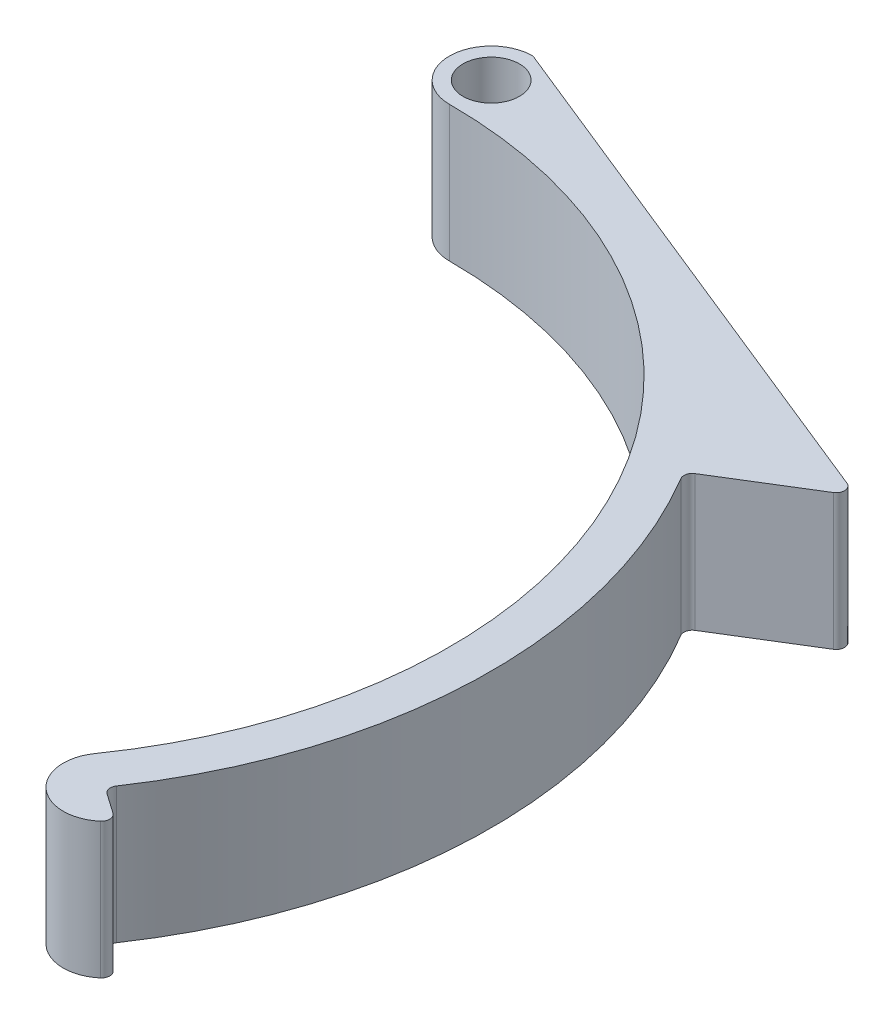
ISO-10303-21;
HEADER;
FILE_DESCRIPTION(('STEP AP214'),'2;1');
FILE_NAME('part.step','',(''),(''),'','','');
FILE_SCHEMA(('AUTOMOTIVE_DESIGN { 1 0 10303 214 1 1 1 1 }'));
ENDSEC;
DATA;
#1=APPLICATION_CONTEXT('core data for automotive mechanical design processes');
#2=APPLICATION_PROTOCOL_DEFINITION('international standard','automotive_design',2000,#1);
#3=PRODUCT_CONTEXT('',#1,'mechanical');
#4=PRODUCT('Part','Part','',(#3));
#5=PRODUCT_RELATED_PRODUCT_CATEGORY('part','',(#4));
#6=PRODUCT_DEFINITION_FORMATION('','',#4);
#7=PRODUCT_DEFINITION_CONTEXT('part definition',#1,'design');
#8=PRODUCT_DEFINITION('design','',#6,#7);
#9=PRODUCT_DEFINITION_SHAPE('','',#8);
#10=(LENGTH_UNIT() NAMED_UNIT(*) SI_UNIT(.MILLI.,.METRE.));
#11=(NAMED_UNIT(*) PLANE_ANGLE_UNIT() SI_UNIT($,.RADIAN.));
#12=(NAMED_UNIT(*) SI_UNIT($,.STERADIAN.) SOLID_ANGLE_UNIT());
#13=UNCERTAINTY_MEASURE_WITH_UNIT(LENGTH_MEASURE(1.E-05),#10,'distance_accuracy_value','');
#14=(GEOMETRIC_REPRESENTATION_CONTEXT(3) GLOBAL_UNCERTAINTY_ASSIGNED_CONTEXT((#13)) GLOBAL_UNIT_ASSIGNED_CONTEXT((#10,
#11,#12)) REPRESENTATION_CONTEXT('',''));
#15=CARTESIAN_POINT('',(0.,0.,0.));
#16=DIRECTION('',(0.,0.,1.));
#17=DIRECTION('',(1.,0.,0.));
#18=AXIS2_PLACEMENT_3D('',#15,#16,#17);
#19=CARTESIAN_POINT('',(18.4107690922549,13.,-45.5602618405853));
#20=DIRECTION('',(0.374663072776281,0.,-0.927161033422908));
#21=DIRECTION('',(-0.927161033422908,0.,-0.374663072776281));
#22=AXIS2_PLACEMENT_3D('',#19,#20,#21);
#23=PLANE('',#22);
#24=DIRECTION('',(0.927161033422908,0.,0.374663072776281));
#25=VECTOR('',#24,1.);
#26=CARTESIAN_POINT('',(18.4107690922549,0.,-45.5602618405853));
#27=LINE('',#26,#25);
#28=CARTESIAN_POINT('',(0.152578115339287,0.,-52.938343628053));
#29=VERTEX_POINT('',#28);
#30=CARTESIAN_POINT('',(50.4547105940548,0.,-32.6113984240491));
#31=VERTEX_POINT('',#30);
#32=EDGE_CURVE('E189',#29,#31,#27,.T.);
#33=ORIENTED_EDGE('',*,*,#32,.F.);
#34=DIRECTION('',(0.,-1.,0.));
#35=VECTOR('',#34,1.);
#36=CARTESIAN_POINT('',(0.152578115339284,13.,-52.938343628053));
#37=LINE('',#36,#35);
#38=CARTESIAN_POINT('',(0.152578115339287,13.,-52.938343628053));
#39=VERTEX_POINT('',#38);
#40=EDGE_CURVE('E231',#29,#39,#37,.F.);
#41=ORIENTED_EDGE('',*,*,#40,.T.);
#42=DIRECTION('',(0.927161033422908,0.,0.374663072776281));
#43=VECTOR('',#42,1.);
#44=CARTESIAN_POINT('',(18.4107690922549,13.,-45.5602618405853));
#45=LINE('',#44,#43);
#46=CARTESIAN_POINT('',(50.4547105940548,13.,-32.6113984240491));
#47=VERTEX_POINT('',#46);
#48=EDGE_CURVE('E165',#39,#47,#45,.T.);
#49=ORIENTED_EDGE('',*,*,#48,.T.);
#50=DIRECTION('',(0.,-1.,0.));
#51=VECTOR('',#50,1.);
#52=CARTESIAN_POINT('',(50.4547105940548,13.,-32.6113984240491));
#53=LINE('',#52,#51);
#54=EDGE_CURVE('E227',#47,#31,#53,.T.);
#55=ORIENTED_EDGE('',*,*,#54,.T.);
#56=EDGE_LOOP('',(#33,#41,#49,#55));
#57=FACE_BOUND('',#56,.T.);
#58=ADVANCED_FACE('F45',(#57),#23,.T.);
#59=CARTESIAN_POINT('',(0.,13.,-49.));
#60=DIRECTION('',(0.,-1.,0.));
#61=DIRECTION('',(0.,0.,-1.));
#62=AXIS2_PLACEMENT_3D('',#59,#60,#61);
#63=CYLINDRICAL_SURFACE('',#62,4.);
#64=CARTESIAN_POINT('',(0.,13.,-49.));
#65=DIRECTION('',(0.,1.,0.));
#66=DIRECTION('',(0.,0.,1.));
#67=AXIS2_PLACEMENT_3D('',#64,#65,#66);
#68=CIRCLE('',#67,4.);
#69=CARTESIAN_POINT('',(0.,13.,-45.));
#70=VERTEX_POINT('',#69);
#71=CARTESIAN_POINT('',(-0.183940428602176,13.,-52.9957685016434));
#72=VERTEX_POINT('',#71);
#73=EDGE_CURVE('E140',#70,#72,#68,.F.);
#74=ORIENTED_EDGE('',*,*,#73,.T.);
#75=DIRECTION('',(0.,-1.,0.));
#76=VECTOR('',#75,1.);
#77=CARTESIAN_POINT('',(-0.183940428602176,13.,-52.9957685016434));
#78=LINE('',#77,#76);
#79=CARTESIAN_POINT('',(-0.183940428602176,0.,-52.9957685016434));
#80=VERTEX_POINT('',#79);
#81=EDGE_CURVE('E148',#72,#80,#78,.T.);
#82=ORIENTED_EDGE('',*,*,#81,.T.);
#83=CARTESIAN_POINT('',(0.,0.,-49.));
#84=DIRECTION('',(0.,1.,0.));
#85=DIRECTION('',(0.,0.,1.));
#86=AXIS2_PLACEMENT_3D('',#83,#84,#85);
#87=CIRCLE('',#86,4.);
#88=CARTESIAN_POINT('',(0.,0.,-45.));
#89=VERTEX_POINT('',#88);
#90=EDGE_CURVE('E143',#89,#80,#87,.F.);
#91=ORIENTED_EDGE('',*,*,#90,.F.);
#92=DIRECTION('',(0.,-1.,0.));
#93=VECTOR('',#92,1.);
#94=CARTESIAN_POINT('',(0.,13.,-45.));
#95=LINE('',#94,#93);
#96=EDGE_CURVE('E135',#70,#89,#95,.T.);
#97=ORIENTED_EDGE('',*,*,#96,.F.);
#98=EDGE_LOOP('',(#74,#82,#91,#97));
#99=FACE_BOUND('',#98,.T.);
#100=ADVANCED_FACE('F137',(#99),#63,.T.);
#101=CARTESIAN_POINT('',(0.,13.,0.));
#102=DIRECTION('',(0.,-1.,0.));
#103=DIRECTION('',(0.,0.,-1.));
#104=AXIS2_PLACEMENT_3D('',#101,#102,#103);
#105=CYLINDRICAL_SURFACE('',#104,45.);
#106=CARTESIAN_POINT('',(0.,0.,0.));
#107=DIRECTION('',(0.,1.,0.));
#108=DIRECTION('',(0.,0.,1.));
#109=AXIS2_PLACEMENT_3D('',#106,#107,#108);
#110=CIRCLE('',#109,45.);
#111=CARTESIAN_POINT('',(36.8618419930047,0.,25.810939635797));
#112=VERTEX_POINT('',#111);
#113=EDGE_CURVE('E195',#89,#112,#110,.F.);
#114=ORIENTED_EDGE('',*,*,#113,.T.);
#115=DIRECTION('',(0.,-1.,0.));
#116=VECTOR('',#115,1.);
#117=CARTESIAN_POINT('',(36.8618419930047,13.,25.810939635797));
#118=LINE('',#117,#116);
#119=CARTESIAN_POINT('',(36.8618419930047,13.,25.810939635797));
#120=VERTEX_POINT('',#119);
#121=EDGE_CURVE('E149',#120,#112,#118,.T.);
#122=ORIENTED_EDGE('',*,*,#121,.F.);
#123=CARTESIAN_POINT('',(0.,13.,0.));
#124=DIRECTION('',(0.,1.,0.));
#125=DIRECTION('',(0.,0.,1.));
#126=AXIS2_PLACEMENT_3D('',#123,#124,#125);
#127=CIRCLE('',#126,45.);
#128=EDGE_CURVE('E153',#70,#120,#127,.F.);
#129=ORIENTED_EDGE('',*,*,#128,.F.);
#130=ORIENTED_EDGE('',*,*,#96,.T.);
#131=EDGE_LOOP('',(#114,#122,#129,#130));
#132=FACE_BOUND('',#131,.T.);
#133=ADVANCED_FACE('F154',(#132),#105,.F.);
#134=CARTESIAN_POINT('',(40.1384501701607,13.,28.1052453812011));
#135=DIRECTION('',(0.,-1.,0.));
#136=DIRECTION('',(0.,0.,-1.));
#137=AXIS2_PLACEMENT_3D('',#134,#135,#136);
#138=CYLINDRICAL_SURFACE('',#137,4.);
#139=CARTESIAN_POINT('',(40.1384501701607,0.,28.1052453812011));
#140=DIRECTION('',(0.,1.,0.));
#141=DIRECTION('',(0.,0.,1.));
#142=AXIS2_PLACEMENT_3D('',#139,#140,#141);
#143=CIRCLE('',#142,4.);
#144=CARTESIAN_POINT('',(42.7374359593527,0.,31.1458494112547));
#145=VERTEX_POINT('',#144);
#146=EDGE_CURVE('E198',#112,#145,#143,.T.);
#147=ORIENTED_EDGE('',*,*,#146,.T.);
#148=DIRECTION('',(0.,-1.,0.));
#149=VECTOR('',#148,1.);
#150=CARTESIAN_POINT('',(42.7374359593527,13.,31.1458494112547));
#151=LINE('',#150,#149);
#152=CARTESIAN_POINT('',(42.7374359593527,13.,31.1458494112547));
#153=VERTEX_POINT('',#152);
#154=EDGE_CURVE('E256',#145,#153,#151,.F.);
#155=ORIENTED_EDGE('',*,*,#154,.T.);
#156=CARTESIAN_POINT('',(40.1384501701607,13.,28.1052453812011));
#157=DIRECTION('',(0.,1.,0.));
#158=DIRECTION('',(0.,0.,1.));
#159=AXIS2_PLACEMENT_3D('',#156,#157,#158);
#160=CIRCLE('',#159,4.);
#161=EDGE_CURVE('E158',#120,#153,#160,.T.);
#162=ORIENTED_EDGE('',*,*,#161,.F.);
#163=ORIENTED_EDGE('',*,*,#121,.T.);
#164=EDGE_LOOP('',(#147,#155,#162,#163));
#165=FACE_BOUND('',#164,.T.);
#166=ADVANCED_FACE('F334',(#165),#138,.T.);
#167=CARTESIAN_POINT('',(0.,13.,0.));
#168=DIRECTION('',(0.573576436351042,0.,-0.819152044288994));
#169=DIRECTION('',(-0.819152044288995,0.,-0.573576436351042));
#170=AXIS2_PLACEMENT_3D('',#167,#168,#169);
#171=PLANE('',#170);
#172=DIRECTION('',(0.819152044288994,0.,0.573576436351042));
#173=VECTOR('',#172,1.);
#174=CARTESIAN_POINT('',(0.,0.,0.));
#175=LINE('',#174,#173);
#176=CARTESIAN_POINT('',(40.7885078383708,0.,28.5604206607529));
#177=VERTEX_POINT('',#176);
#178=CARTESIAN_POINT('',(42.6764999505951,0.,29.8824069698128));
#179=VERTEX_POINT('',#178);
#180=EDGE_CURVE('E202',#177,#179,#175,.T.);
#181=ORIENTED_EDGE('',*,*,#180,.F.);
#182=DIRECTION('',(0.,-1.,0.));
#183=VECTOR('',#182,1.);
#184=CARTESIAN_POINT('',(40.7885078383708,13.,28.5604206607529));
#185=LINE('',#184,#183);
#186=CARTESIAN_POINT('',(40.7885078383708,13.,28.5604206607529));
#187=VERTEX_POINT('',#186);
#188=EDGE_CURVE('E253',#177,#187,#185,.F.);
#189=ORIENTED_EDGE('',*,*,#188,.T.);
#190=DIRECTION('',(0.819152044288994,0.,0.573576436351042));
#191=VECTOR('',#190,1.);
#192=CARTESIAN_POINT('',(0.,13.,0.));
#193=LINE('',#192,#191);
#194=CARTESIAN_POINT('',(42.6764999505951,13.,29.8824069698128));
#195=VERTEX_POINT('',#194);
#196=EDGE_CURVE('E175',#187,#195,#193,.T.);
#197=ORIENTED_EDGE('',*,*,#196,.T.);
#198=DIRECTION('',(0.,1.,0.));
#199=VECTOR('',#198,1.);
#200=CARTESIAN_POINT('',(42.6764999505951,0.,29.8824069698128));
#201=LINE('',#200,#199);
#202=EDGE_CURVE('E249',#195,#179,#201,.F.);
#203=ORIENTED_EDGE('',*,*,#202,.T.);
#204=EDGE_LOOP('',(#181,#189,#197,#203));
#205=FACE_BOUND('',#204,.T.);
#206=ADVANCED_FACE('F319',(#205),#171,.T.);
#207=CARTESIAN_POINT('',(0.,13.,0.));
#208=DIRECTION('',(0.,-1.,0.));
#209=DIRECTION('',(0.,0.,-1.));
#210=AXIS2_PLACEMENT_3D('',#207,#208,#209);
#211=CYLINDRICAL_SURFACE('',#210,49.);
#212=CARTESIAN_POINT('',(0.,13.,0.));
#213=DIRECTION('',(0.,1.,0.));
#214=DIRECTION('',(0.,0.,1.));
#215=AXIS2_PLACEMENT_3D('',#212,#213,#214);
#216=CIRCLE('',#215,49.);
#217=CARTESIAN_POINT('',(40.5847606503038,13.,27.456824342184));
#218=VERTEX_POINT('',#217);
#219=CARTESIAN_POINT('',(42.1148392112088,13.,-25.0467626294103));
#220=VERTEX_POINT('',#219);
#221=EDGE_CURVE('E179',#218,#220,#216,.T.);
#222=ORIENTED_EDGE('',*,*,#221,.F.);
#223=DIRECTION('',(0.,-1.,0.));
#224=VECTOR('',#223,1.);
#225=CARTESIAN_POINT('',(40.5847606503038,13.,27.456824342184));
#226=LINE('',#225,#224);
#227=CARTESIAN_POINT('',(40.5847606503038,0.,27.456824342184));
#228=VERTEX_POINT('',#227);
#229=EDGE_CURVE('E245',#218,#228,#226,.T.);
#230=ORIENTED_EDGE('',*,*,#229,.T.);
#231=CARTESIAN_POINT('',(0.,0.,0.));
#232=DIRECTION('',(0.,1.,0.));
#233=DIRECTION('',(0.,0.,1.));
#234=AXIS2_PLACEMENT_3D('',#231,#232,#233);
#235=CIRCLE('',#234,49.);
#236=CARTESIAN_POINT('',(42.1148392112088,0.,-25.0467626294103));
#237=VERTEX_POINT('',#236);
#238=EDGE_CURVE('E206',#228,#237,#235,.T.);
#239=ORIENTED_EDGE('',*,*,#238,.T.);
#240=DIRECTION('',(0.,-1.,0.));
#241=VECTOR('',#240,1.);
#242=CARTESIAN_POINT('',(42.1148392112088,13.,-25.0467626294103));
#243=LINE('',#242,#241);
#244=EDGE_CURVE('E242',#237,#220,#243,.F.);
#245=ORIENTED_EDGE('',*,*,#244,.T.);
#246=EDGE_LOOP('',(#222,#230,#239,#245));
#247=FACE_BOUND('',#246,.T.);
#248=ADVANCED_FACE('F279',(#247),#211,.T.);
#249=CARTESIAN_POINT('',(0.,13.,-49.));
#250=DIRECTION('',(0.,-1.,0.));
#251=DIRECTION('',(0.,0.,-1.));
#252=AXIS2_PLACEMENT_3D('',#249,#250,#251);
#253=CYLINDRICAL_SURFACE('',#252,2.7);
#254=CARTESIAN_POINT('',(0.,13.,-49.));
#255=DIRECTION('',(0.,1.,0.));
#256=DIRECTION('',(0.,0.,1.));
#257=AXIS2_PLACEMENT_3D('',#254,#255,#256);
#258=CIRCLE('',#257,2.7);
#259=CARTESIAN_POINT('',(0.,13.,-46.3));
#260=VERTEX_POINT('',#259);
#261=EDGE_CURVE('E169',#260,#260,#258,.T.);
#262=ORIENTED_EDGE('',*,*,#261,.T.);
#263=EDGE_LOOP('',(#262));
#264=FACE_BOUND('',#263,.T.);
#265=CARTESIAN_POINT('',(0.,0.,-49.));
#266=DIRECTION('',(0.,1.,0.));
#267=DIRECTION('',(0.,0.,1.));
#268=AXIS2_PLACEMENT_3D('',#265,#266,#267);
#269=CIRCLE('',#268,2.7);
#270=CARTESIAN_POINT('',(0.,0.,-46.3));
#271=VERTEX_POINT('',#270);
#272=EDGE_CURVE('E185',#271,#271,#269,.T.);
#273=ORIENTED_EDGE('',*,*,#272,.F.);
#274=EDGE_LOOP('',(#273));
#275=FACE_BOUND('',#274,.T.);
#276=ADVANCED_FACE('F311',(#264,#275),#253,.F.);
#277=CARTESIAN_POINT('',(0.,13.,0.));
#278=DIRECTION('',(0.524899474172595,0.,0.851164227404637));
#279=DIRECTION('',(0.851164227404637,0.,-0.524899474172595));
#280=AXIS2_PLACEMENT_3D('',#277,#278,#279);
#281=PLANE('',#280);
#282=DIRECTION('',(-0.851164227404637,0.,0.524899474172595));
#283=VECTOR('',#282,1.);
#284=CARTESIAN_POINT('',(0.,0.,0.));
#285=LINE('',#284,#283);
#286=CARTESIAN_POINT('',(50.5748997151719,0.,-31.1887382153871));
#287=VERTEX_POINT('',#286);
#288=CARTESIAN_POINT('',(42.3825088434823,0.,-26.1366207481407));
#289=VERTEX_POINT('',#288);
#290=EDGE_CURVE('E210',#287,#289,#285,.T.);
#291=ORIENTED_EDGE('',*,*,#290,.F.);
#292=DIRECTION('',(0.,-1.,0.));
#293=VECTOR('',#292,1.);
#294=CARTESIAN_POINT('',(50.5748997151719,13.,-31.1887382153871));
#295=LINE('',#294,#293);
#296=CARTESIAN_POINT('',(50.5748997151719,13.,-31.1887382153871));
#297=VERTEX_POINT('',#296);
#298=EDGE_CURVE('E66',#287,#297,#295,.F.);
#299=ORIENTED_EDGE('',*,*,#298,.T.);
#300=DIRECTION('',(-0.851164227404637,0.,0.524899474172595));
#301=VECTOR('',#300,1.);
#302=CARTESIAN_POINT('',(0.,13.,0.));
#303=LINE('',#302,#301);
#304=CARTESIAN_POINT('',(42.3825088434823,13.,-26.1366207481407));
#305=VERTEX_POINT('',#304);
#306=EDGE_CURVE('E182',#297,#305,#303,.T.);
#307=ORIENTED_EDGE('',*,*,#306,.T.);
#308=DIRECTION('',(0.,-1.,0.));
#309=VECTOR('',#308,1.);
#310=CARTESIAN_POINT('',(42.3825088434823,13.,-26.1366207481407));
#311=LINE('',#310,#309);
#312=EDGE_CURVE('E259',#305,#289,#311,.T.);
#313=ORIENTED_EDGE('',*,*,#312,.T.);
#314=EDGE_LOOP('',(#291,#299,#307,#313));
#315=FACE_BOUND('',#314,.T.);
#316=ADVANCED_FACE('F281',(#315),#281,.T.);
#317=CARTESIAN_POINT('',(0.,13.,0.));
#318=DIRECTION('',(0.,1.,0.));
#319=DIRECTION('',(0.,0.,1.));
#320=AXIS2_PLACEMENT_3D('',#317,#318,#319);
#321=PLANE('',#320);
#322=ORIENTED_EDGE('',*,*,#261,.F.);
#323=EDGE_LOOP('',(#322));
#324=FACE_BOUND('',#323,.T.);
#325=ORIENTED_EDGE('',*,*,#48,.F.);
#326=CARTESIAN_POINT('',(-0.147152342881741,13.,-52.1966148013147));
#327=DIRECTION('',(0.,1.,0.));
#328=DIRECTION('',(0.,0.,1.));
#329=AXIS2_PLACEMENT_3D('',#326,#327,#328);
#330=CIRCLE('',#329,0.8);
#331=EDGE_CURVE('E163',#39,#72,#330,.T.);
#332=ORIENTED_EDGE('',*,*,#331,.T.);
#333=ORIENTED_EDGE('',*,*,#73,.F.);
#334=ORIENTED_EDGE('',*,*,#128,.T.);
#335=ORIENTED_EDGE('',*,*,#161,.T.);
#336=CARTESIAN_POINT('',(42.2176388015143,13.,30.537728605244));
#337=DIRECTION('',(0.,1.,0.));
#338=DIRECTION('',(0.,0.,1.));
#339=AXIS2_PLACEMENT_3D('',#336,#337,#338);
#340=CIRCLE('',#339,0.8);
#341=EDGE_CURVE('E237',#153,#195,#340,.T.);
#342=ORIENTED_EDGE('',*,*,#341,.T.);
#343=ORIENTED_EDGE('',*,*,#196,.F.);
#344=CARTESIAN_POINT('',(41.2473689874516,13.,27.9050990253217));
#345=DIRECTION('',(0.,1.,0.));
#346=DIRECTION('',(0.,0.,1.));
#347=AXIS2_PLACEMENT_3D('',#344,#345,#346);
#348=CIRCLE('',#347,0.8);
#349=EDGE_CURVE('E268',#187,#218,#348,.F.);
#350=ORIENTED_EDGE('',*,*,#349,.T.);
#351=ORIENTED_EDGE('',*,*,#221,.T.);
#352=CARTESIAN_POINT('',(42.8024284228204,13.,-25.455689366217));
#353=DIRECTION('',(0.,1.,0.));
#354=DIRECTION('',(0.,0.,1.));
#355=AXIS2_PLACEMENT_3D('',#352,#353,#354);
#356=CIRCLE('',#355,0.8);
#357=EDGE_CURVE('E11',#220,#305,#356,.F.);
#358=ORIENTED_EDGE('',*,*,#357,.T.);
#359=ORIENTED_EDGE('',*,*,#306,.F.);
#360=CARTESIAN_POINT('',(50.1549801358338,13.,-31.8696695973108));
#361=DIRECTION('',(0.,1.,0.));
#362=DIRECTION('',(0.,0.,1.));
#363=AXIS2_PLACEMENT_3D('',#360,#361,#362);
#364=CIRCLE('',#363,0.8);
#365=EDGE_CURVE('E234',#297,#47,#364,.T.);
#366=ORIENTED_EDGE('',*,*,#365,.T.);
#367=EDGE_LOOP('',(#325,#332,#333,#334,#335,#342,#343,#350,#351,#358,#359,#366));
#368=FACE_BOUND('',#367,.T.);
#369=ADVANCED_FACE('F161',(#324,#368),#321,.T.);
#370=CARTESIAN_POINT('',(0.,0.,0.));
#371=DIRECTION('',(0.,1.,0.));
#372=DIRECTION('',(0.,0.,1.));
#373=AXIS2_PLACEMENT_3D('',#370,#371,#372);
#374=PLANE('',#373);
#375=ORIENTED_EDGE('',*,*,#272,.T.);
#376=EDGE_LOOP('',(#375));
#377=FACE_BOUND('',#376,.T.);
#378=ORIENTED_EDGE('',*,*,#90,.T.);
#379=CARTESIAN_POINT('',(-0.147152342881741,0.,-52.1966148013147));
#380=DIRECTION('',(0.,1.,0.));
#381=DIRECTION('',(0.,0.,1.));
#382=AXIS2_PLACEMENT_3D('',#379,#380,#381);
#383=CIRCLE('',#382,0.8);
#384=EDGE_CURVE('E224',#80,#29,#383,.F.);
#385=ORIENTED_EDGE('',*,*,#384,.T.);
#386=ORIENTED_EDGE('',*,*,#32,.T.);
#387=CARTESIAN_POINT('',(50.1549801358338,0.,-31.8696695973108));
#388=DIRECTION('',(0.,1.,0.));
#389=DIRECTION('',(0.,0.,1.));
#390=AXIS2_PLACEMENT_3D('',#387,#388,#389);
#391=CIRCLE('',#390,0.8);
#392=EDGE_CURVE('E218',#31,#287,#391,.F.);
#393=ORIENTED_EDGE('',*,*,#392,.T.);
#394=ORIENTED_EDGE('',*,*,#290,.T.);
#395=CARTESIAN_POINT('',(42.8024284228204,0.,-25.455689366217));
#396=DIRECTION('',(0.,1.,0.));
#397=DIRECTION('',(0.,0.,1.));
#398=AXIS2_PLACEMENT_3D('',#395,#396,#397);
#399=CIRCLE('',#398,0.8);
#400=EDGE_CURVE('E54',#289,#237,#399,.T.);
#401=ORIENTED_EDGE('',*,*,#400,.T.);
#402=ORIENTED_EDGE('',*,*,#238,.F.);
#403=CARTESIAN_POINT('',(41.2473689874516,0.,27.9050990253217));
#404=DIRECTION('',(0.,1.,0.));
#405=DIRECTION('',(0.,0.,1.));
#406=AXIS2_PLACEMENT_3D('',#403,#404,#405);
#407=CIRCLE('',#406,0.8);
#408=EDGE_CURVE('E265',#228,#177,#407,.T.);
#409=ORIENTED_EDGE('',*,*,#408,.T.);
#410=ORIENTED_EDGE('',*,*,#180,.T.);
#411=CARTESIAN_POINT('',(42.2176388015143,0.,30.537728605244));
#412=DIRECTION('',(0.,1.,0.));
#413=DIRECTION('',(0.,0.,1.));
#414=AXIS2_PLACEMENT_3D('',#411,#412,#413);
#415=CIRCLE('',#414,0.8);
#416=EDGE_CURVE('E221',#179,#145,#415,.F.);
#417=ORIENTED_EDGE('',*,*,#416,.T.);
#418=ORIENTED_EDGE('',*,*,#146,.F.);
#419=ORIENTED_EDGE('',*,*,#113,.F.);
#420=EDGE_LOOP('',(#378,#385,#386,#393,#394,#401,#402,#409,#410,#417,#418,#419));
#421=FACE_BOUND('',#420,.T.);
#422=ADVANCED_FACE('F273',(#377,#421),#374,.F.);
#423=CARTESIAN_POINT('',(-0.147152342881741,13.,-52.1966148013147));
#424=DIRECTION('',(0.,-1.,0.));
#425=DIRECTION('',(0.,0.,-1.));
#426=AXIS2_PLACEMENT_3D('',#423,#424,#425);
#427=CYLINDRICAL_SURFACE('',#426,0.8);
#428=ORIENTED_EDGE('',*,*,#331,.F.);
#429=ORIENTED_EDGE('',*,*,#40,.F.);
#430=ORIENTED_EDGE('',*,*,#384,.F.);
#431=ORIENTED_EDGE('',*,*,#81,.F.);
#432=EDGE_LOOP('',(#428,#429,#430,#431));
#433=FACE_BOUND('',#432,.T.);
#434=ADVANCED_FACE('F290',(#433),#427,.T.);
#435=CARTESIAN_POINT('',(41.2473689874516,13.,27.9050990253217));
#436=DIRECTION('',(0.,-1.,0.));
#437=DIRECTION('',(0.,0.,-1.));
#438=AXIS2_PLACEMENT_3D('',#435,#436,#437);
#439=CYLINDRICAL_SURFACE('',#438,0.8);
#440=ORIENTED_EDGE('',*,*,#349,.F.);
#441=ORIENTED_EDGE('',*,*,#188,.F.);
#442=ORIENTED_EDGE('',*,*,#408,.F.);
#443=ORIENTED_EDGE('',*,*,#229,.F.);
#444=EDGE_LOOP('',(#440,#441,#442,#443));
#445=FACE_BOUND('',#444,.T.);
#446=ADVANCED_FACE('F292',(#445),#439,.F.);
#447=CARTESIAN_POINT('',(42.2176388015143,13.,30.537728605244));
#448=DIRECTION('',(0.,-1.,0.));
#449=DIRECTION('',(0.,0.,-1.));
#450=AXIS2_PLACEMENT_3D('',#447,#448,#449);
#451=CYLINDRICAL_SURFACE('',#450,0.8);
#452=ORIENTED_EDGE('',*,*,#341,.F.);
#453=ORIENTED_EDGE('',*,*,#154,.F.);
#454=ORIENTED_EDGE('',*,*,#416,.F.);
#455=ORIENTED_EDGE('',*,*,#202,.F.);
#456=EDGE_LOOP('',(#452,#453,#454,#455));
#457=FACE_BOUND('',#456,.T.);
#458=ADVANCED_FACE('F298',(#457),#451,.T.);
#459=CARTESIAN_POINT('',(50.1549801358338,13.,-31.8696695973108));
#460=DIRECTION('',(0.,-1.,0.));
#461=DIRECTION('',(0.,0.,-1.));
#462=AXIS2_PLACEMENT_3D('',#459,#460,#461);
#463=CYLINDRICAL_SURFACE('',#462,0.8);
#464=ORIENTED_EDGE('',*,*,#365,.F.);
#465=ORIENTED_EDGE('',*,*,#298,.F.);
#466=ORIENTED_EDGE('',*,*,#392,.F.);
#467=ORIENTED_EDGE('',*,*,#54,.F.);
#468=EDGE_LOOP('',(#464,#465,#466,#467));
#469=FACE_BOUND('',#468,.T.);
#470=ADVANCED_FACE('F285',(#469),#463,.T.);
#471=CARTESIAN_POINT('',(42.8024284228204,13.,-25.455689366217));
#472=DIRECTION('',(0.,-1.,0.));
#473=DIRECTION('',(0.,0.,-1.));
#474=AXIS2_PLACEMENT_3D('',#471,#472,#473);
#475=CYLINDRICAL_SURFACE('',#474,0.8);
#476=ORIENTED_EDGE('',*,*,#357,.F.);
#477=ORIENTED_EDGE('',*,*,#244,.F.);
#478=ORIENTED_EDGE('',*,*,#400,.F.);
#479=ORIENTED_EDGE('',*,*,#312,.F.);
#480=EDGE_LOOP('',(#476,#477,#478,#479));
#481=FACE_BOUND('',#480,.T.);
#482=ADVANCED_FACE('F47',(#481),#475,.F.);
#483=CLOSED_SHELL('',(#58,#100,#133,#166,#206,#248,#276,#316,#369,#422,#434,#446,#458,#470,#482));
#484=MANIFOLD_SOLID_BREP('B2',#483);
#485=ADVANCED_BREP_SHAPE_REPRESENTATION('',(#18,#484),#14);
#486=SHAPE_DEFINITION_REPRESENTATION(#9,#485);
ENDSEC;
END-ISO-10303-21;
